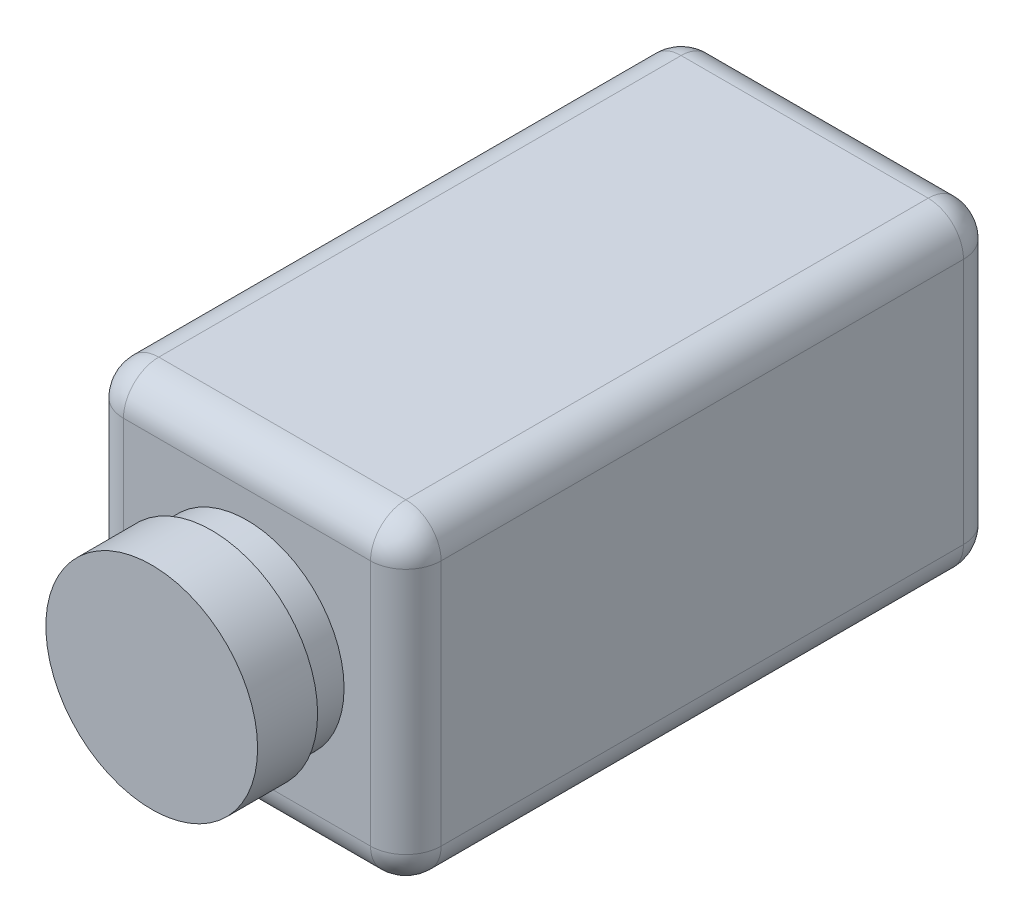
ISO-10303-21;
HEADER;
FILE_DESCRIPTION(('STEP AP214'),'2;1');
FILE_NAME('part.step','',(''),(''),'','','');
FILE_SCHEMA(('AUTOMOTIVE_DESIGN { 1 0 10303 214 1 1 1 1 }'));
ENDSEC;
DATA;
#1=APPLICATION_CONTEXT('core data for automotive mechanical design processes');
#2=APPLICATION_PROTOCOL_DEFINITION('international standard','automotive_design',2000,#1);
#3=PRODUCT_CONTEXT('',#1,'mechanical');
#4=PRODUCT('Part','Part','',(#3));
#5=PRODUCT_RELATED_PRODUCT_CATEGORY('part','',(#4));
#6=PRODUCT_DEFINITION_FORMATION('','',#4);
#7=PRODUCT_DEFINITION_CONTEXT('part definition',#1,'design');
#8=PRODUCT_DEFINITION('design','',#6,#7);
#9=PRODUCT_DEFINITION_SHAPE('','',#8);
#10=(LENGTH_UNIT() NAMED_UNIT(*) SI_UNIT(.MILLI.,.METRE.));
#11=(NAMED_UNIT(*) PLANE_ANGLE_UNIT() SI_UNIT($,.RADIAN.));
#12=(NAMED_UNIT(*) SI_UNIT($,.STERADIAN.) SOLID_ANGLE_UNIT());
#13=UNCERTAINTY_MEASURE_WITH_UNIT(LENGTH_MEASURE(1.E-05),#10,'distance_accuracy_value','');
#14=(GEOMETRIC_REPRESENTATION_CONTEXT(3) GLOBAL_UNCERTAINTY_ASSIGNED_CONTEXT((#13)) GLOBAL_UNIT_ASSIGNED_CONTEXT((#10,
#11,#12)) REPRESENTATION_CONTEXT('',''));
#15=CARTESIAN_POINT('',(0.,0.,0.));
#16=DIRECTION('',(0.,0.,1.));
#17=DIRECTION('',(1.,0.,0.));
#18=AXIS2_PLACEMENT_3D('',#15,#16,#17);
#19=CARTESIAN_POINT('',(0.,0.,168.));
#20=DIRECTION('',(1.,0.,0.));
#21=DIRECTION('',(0.,1.,0.));
#22=AXIS2_PLACEMENT_3D('',#19,#20,#21);
#23=PLANE('',#22);
#24=DIRECTION('',(0.,0.,-1.));
#25=VECTOR('',#24,1.);
#26=CARTESIAN_POINT('',(0.,-80.,168.));
#27=LINE('',#26,#25);
#28=CARTESIAN_POINT('',(0.,-80.,10.));
#29=VERTEX_POINT('',#28);
#30=CARTESIAN_POINT('',(0.,-80.,158.));
#31=VERTEX_POINT('',#30);
#32=EDGE_CURVE('E180',#29,#31,#27,.F.);
#33=ORIENTED_EDGE('',*,*,#32,.T.);
#34=DIRECTION('',(0.,-1.,0.));
#35=VECTOR('',#34,1.);
#36=CARTESIAN_POINT('',(0.,0.,158.));
#37=LINE('',#36,#35);
#38=CARTESIAN_POINT('',(0.,-10.,158.));
#39=VERTEX_POINT('',#38);
#40=EDGE_CURVE('E182',#31,#39,#37,.F.);
#41=ORIENTED_EDGE('',*,*,#40,.T.);
#42=DIRECTION('',(0.,0.,-1.));
#43=VECTOR('',#42,1.);
#44=CARTESIAN_POINT('',(0.,-10.,168.));
#45=LINE('',#44,#43);
#46=CARTESIAN_POINT('',(0.,-10.,10.));
#47=VERTEX_POINT('',#46);
#48=EDGE_CURVE('E176',#39,#47,#45,.T.);
#49=ORIENTED_EDGE('',*,*,#48,.T.);
#50=DIRECTION('',(0.,-1.,0.));
#51=VECTOR('',#50,1.);
#52=CARTESIAN_POINT('',(0.,0.,10.));
#53=LINE('',#52,#51);
#54=EDGE_CURVE('E178',#47,#29,#53,.T.);
#55=ORIENTED_EDGE('',*,*,#54,.T.);
#56=EDGE_LOOP('',(#33,#41,#49,#55));
#57=FACE_BOUND('',#56,.T.);
#58=ADVANCED_FACE('F32',(#57),#23,.F.);
#59=CARTESIAN_POINT('',(0.,-90.,168.));
#60=DIRECTION('',(0.,1.,0.));
#61=DIRECTION('',(0.,0.,1.));
#62=AXIS2_PLACEMENT_3D('',#59,#60,#61);
#63=PLANE('',#62);
#64=DIRECTION('',(1.,0.,0.));
#65=VECTOR('',#64,1.);
#66=CARTESIAN_POINT('',(0.,-90.,158.));
#67=LINE('',#66,#65);
#68=CARTESIAN_POINT('',(80.,-90.,158.));
#69=VERTEX_POINT('',#68);
#70=CARTESIAN_POINT('',(10.,-90.,158.));
#71=VERTEX_POINT('',#70);
#72=EDGE_CURVE('E128',#69,#71,#67,.F.);
#73=ORIENTED_EDGE('',*,*,#72,.T.);
#74=DIRECTION('',(0.,0.,-1.));
#75=VECTOR('',#74,1.);
#76=CARTESIAN_POINT('',(10.,-90.,168.));
#77=LINE('',#76,#75);
#78=CARTESIAN_POINT('',(10.,-90.,10.));
#79=VERTEX_POINT('',#78);
#80=EDGE_CURVE('E165',#71,#79,#77,.T.);
#81=ORIENTED_EDGE('',*,*,#80,.T.);
#82=DIRECTION('',(1.,0.,0.));
#83=VECTOR('',#82,1.);
#84=CARTESIAN_POINT('',(0.,-90.,10.));
#85=LINE('',#84,#83);
#86=CARTESIAN_POINT('',(80.,-90.,10.));
#87=VERTEX_POINT('',#86);
#88=EDGE_CURVE('E158',#79,#87,#85,.T.);
#89=ORIENTED_EDGE('',*,*,#88,.T.);
#90=DIRECTION('',(0.,0.,-1.));
#91=VECTOR('',#90,1.);
#92=CARTESIAN_POINT('',(80.,-90.,168.));
#93=LINE('',#92,#91);
#94=EDGE_CURVE('E156',#87,#69,#93,.F.);
#95=ORIENTED_EDGE('',*,*,#94,.T.);
#96=EDGE_LOOP('',(#73,#81,#89,#95));
#97=FACE_BOUND('',#96,.T.);
#98=ADVANCED_FACE('F326',(#97),#63,.F.);
#99=CARTESIAN_POINT('',(90.,0.,168.));
#100=DIRECTION('',(-1.,0.,0.));
#101=DIRECTION('',(0.,-1.,0.));
#102=AXIS2_PLACEMENT_3D('',#99,#100,#101);
#103=PLANE('',#102);
#104=DIRECTION('',(0.,1.,0.));
#105=VECTOR('',#104,1.);
#106=CARTESIAN_POINT('',(90.,-90.,158.));
#107=LINE('',#106,#105);
#108=CARTESIAN_POINT('',(90.,-10.,158.));
#109=VERTEX_POINT('',#108);
#110=CARTESIAN_POINT('',(90.,-80.,158.));
#111=VERTEX_POINT('',#110);
#112=EDGE_CURVE('E41',#109,#111,#107,.F.);
#113=ORIENTED_EDGE('',*,*,#112,.T.);
#114=DIRECTION('',(0.,0.,-1.));
#115=VECTOR('',#114,1.);
#116=CARTESIAN_POINT('',(90.,-80.,168.));
#117=LINE('',#116,#115);
#118=CARTESIAN_POINT('',(90.,-80.,10.));
#119=VERTEX_POINT('',#118);
#120=EDGE_CURVE('E11',#111,#119,#117,.T.);
#121=ORIENTED_EDGE('',*,*,#120,.T.);
#122=DIRECTION('',(0.,1.,0.));
#123=VECTOR('',#122,1.);
#124=CARTESIAN_POINT('',(90.,0.,10.));
#125=LINE('',#124,#123);
#126=CARTESIAN_POINT('',(90.,-10.,10.));
#127=VERTEX_POINT('',#126);
#128=EDGE_CURVE('E194',#119,#127,#125,.T.);
#129=ORIENTED_EDGE('',*,*,#128,.T.);
#130=DIRECTION('',(0.,0.,-1.));
#131=VECTOR('',#130,1.);
#132=CARTESIAN_POINT('',(90.,-10.,168.));
#133=LINE('',#132,#131);
#134=EDGE_CURVE('E52',#127,#109,#133,.F.);
#135=ORIENTED_EDGE('',*,*,#134,.T.);
#136=EDGE_LOOP('',(#113,#121,#129,#135));
#137=FACE_BOUND('',#136,.T.);
#138=ADVANCED_FACE('F331',(#137),#103,.F.);
#139=CARTESIAN_POINT('',(0.,0.,168.));
#140=DIRECTION('',(0.,-1.,0.));
#141=DIRECTION('',(0.,0.,-1.));
#142=AXIS2_PLACEMENT_3D('',#139,#140,#141);
#143=PLANE('',#142);
#144=DIRECTION('',(0.,0.,-1.));
#145=VECTOR('',#144,1.);
#146=CARTESIAN_POINT('',(10.,0.,168.));
#147=LINE('',#146,#145);
#148=CARTESIAN_POINT('',(10.,0.,10.));
#149=VERTEX_POINT('',#148);
#150=CARTESIAN_POINT('',(10.,0.,158.));
#151=VERTEX_POINT('',#150);
#152=EDGE_CURVE('E189',#149,#151,#147,.F.);
#153=ORIENTED_EDGE('',*,*,#152,.T.);
#154=DIRECTION('',(-1.,0.,0.));
#155=VECTOR('',#154,1.);
#156=CARTESIAN_POINT('',(90.,0.,158.));
#157=LINE('',#156,#155);
#158=CARTESIAN_POINT('',(80.,0.,158.));
#159=VERTEX_POINT('',#158);
#160=EDGE_CURVE('E191',#151,#159,#157,.F.);
#161=ORIENTED_EDGE('',*,*,#160,.T.);
#162=DIRECTION('',(0.,0.,-1.));
#163=VECTOR('',#162,1.);
#164=CARTESIAN_POINT('',(80.,0.,168.));
#165=LINE('',#164,#163);
#166=CARTESIAN_POINT('',(80.,0.,10.));
#167=VERTEX_POINT('',#166);
#168=EDGE_CURVE('E185',#159,#167,#165,.T.);
#169=ORIENTED_EDGE('',*,*,#168,.T.);
#170=DIRECTION('',(-1.,0.,0.));
#171=VECTOR('',#170,1.);
#172=CARTESIAN_POINT('',(0.,0.,10.));
#173=LINE('',#172,#171);
#174=EDGE_CURVE('E187',#167,#149,#173,.T.);
#175=ORIENTED_EDGE('',*,*,#174,.T.);
#176=EDGE_LOOP('',(#153,#161,#169,#175));
#177=FACE_BOUND('',#176,.T.);
#178=ADVANCED_FACE('F277',(#177),#143,.F.);
#179=CARTESIAN_POINT('',(0.,0.,168.));
#180=DIRECTION('',(0.,0.,1.));
#181=DIRECTION('',(1.,0.,0.));
#182=AXIS2_PLACEMENT_3D('',#179,#180,#181);
#183=PLANE('',#182);
#184=CARTESIAN_POINT('',(45.,-45.,168.));
#185=DIRECTION('',(0.,0.,1.));
#186=DIRECTION('',(1.,0.,0.));
#187=AXIS2_PLACEMENT_3D('',#184,#185,#186);
#188=CIRCLE('',#187,27.5);
#189=CARTESIAN_POINT('',(72.5,-45.,168.));
#190=VERTEX_POINT('',#189);
#191=EDGE_CURVE('E388',#190,#190,#188,.T.);
#192=ORIENTED_EDGE('',*,*,#191,.F.);
#193=EDGE_LOOP('',(#192));
#194=FACE_BOUND('',#193,.T.);
#195=DIRECTION('',(0.,-1.,0.));
#196=VECTOR('',#195,1.);
#197=CARTESIAN_POINT('',(10.,-90.,168.));
#198=LINE('',#197,#196);
#199=CARTESIAN_POINT('',(10.,-10.,168.));
#200=VERTEX_POINT('',#199);
#201=CARTESIAN_POINT('',(10.,-80.,168.));
#202=VERTEX_POINT('',#201);
#203=EDGE_CURVE('E154',#200,#202,#198,.T.);
#204=ORIENTED_EDGE('',*,*,#203,.T.);
#205=DIRECTION('',(1.,0.,0.));
#206=VECTOR('',#205,1.);
#207=CARTESIAN_POINT('',(90.,-80.,168.));
#208=LINE('',#207,#206);
#209=CARTESIAN_POINT('',(80.,-80.,168.));
#210=VERTEX_POINT('',#209);
#211=EDGE_CURVE('E126',#202,#210,#208,.T.);
#212=ORIENTED_EDGE('',*,*,#211,.T.);
#213=DIRECTION('',(0.,1.,0.));
#214=VECTOR('',#213,1.);
#215=CARTESIAN_POINT('',(80.,0.,168.));
#216=LINE('',#215,#214);
#217=CARTESIAN_POINT('',(80.,-10.,168.));
#218=VERTEX_POINT('',#217);
#219=EDGE_CURVE('E144',#210,#218,#216,.T.);
#220=ORIENTED_EDGE('',*,*,#219,.T.);
#221=DIRECTION('',(-1.,0.,0.));
#222=VECTOR('',#221,1.);
#223=CARTESIAN_POINT('',(0.,-10.,168.));
#224=LINE('',#223,#222);
#225=EDGE_CURVE('E150',#218,#200,#224,.T.);
#226=ORIENTED_EDGE('',*,*,#225,.T.);
#227=EDGE_LOOP('',(#204,#212,#220,#226));
#228=FACE_BOUND('',#227,.T.);
#229=ADVANCED_FACE('F152',(#194,#228),#183,.T.);
#230=CARTESIAN_POINT('',(0.,0.,0.));
#231=DIRECTION('',(0.,0.,1.));
#232=DIRECTION('',(1.,0.,0.));
#233=AXIS2_PLACEMENT_3D('',#230,#231,#232);
#234=PLANE('',#233);
#235=DIRECTION('',(0.,1.,0.));
#236=VECTOR('',#235,1.);
#237=CARTESIAN_POINT('',(80.,0.,0.));
#238=LINE('',#237,#236);
#239=CARTESIAN_POINT('',(80.,-10.,0.));
#240=VERTEX_POINT('',#239);
#241=CARTESIAN_POINT('',(80.,-80.,0.));
#242=VERTEX_POINT('',#241);
#243=EDGE_CURVE('E167',#240,#242,#238,.F.);
#244=ORIENTED_EDGE('',*,*,#243,.T.);
#245=DIRECTION('',(1.,0.,0.));
#246=VECTOR('',#245,1.);
#247=CARTESIAN_POINT('',(0.,-80.,0.));
#248=LINE('',#247,#246);
#249=CARTESIAN_POINT('',(10.,-80.,0.));
#250=VERTEX_POINT('',#249);
#251=EDGE_CURVE('E173',#242,#250,#248,.F.);
#252=ORIENTED_EDGE('',*,*,#251,.T.);
#253=DIRECTION('',(0.,-1.,0.));
#254=VECTOR('',#253,1.);
#255=CARTESIAN_POINT('',(10.,0.,0.));
#256=LINE('',#255,#254);
#257=CARTESIAN_POINT('',(10.,-10.,0.));
#258=VERTEX_POINT('',#257);
#259=EDGE_CURVE('E171',#250,#258,#256,.F.);
#260=ORIENTED_EDGE('',*,*,#259,.T.);
#261=DIRECTION('',(-1.,0.,0.));
#262=VECTOR('',#261,1.);
#263=CARTESIAN_POINT('',(0.,-10.,0.));
#264=LINE('',#263,#262);
#265=EDGE_CURVE('E169',#258,#240,#264,.F.);
#266=ORIENTED_EDGE('',*,*,#265,.T.);
#267=EDGE_LOOP('',(#244,#252,#260,#266));
#268=FACE_BOUND('',#267,.T.);
#269=ADVANCED_FACE('F295',(#268),#234,.F.);
#270=CARTESIAN_POINT('',(0.,-10.,10.));
#271=DIRECTION('',(-1.,0.,0.));
#272=DIRECTION('',(0.,0.,1.));
#273=AXIS2_PLACEMENT_3D('',#270,#271,#272);
#274=CYLINDRICAL_SURFACE('',#273,10.);
#275=CARTESIAN_POINT('',(10.,-10.,10.));
#276=DIRECTION('',(-1.,0.,0.));
#277=DIRECTION('',(0.,0.,1.));
#278=AXIS2_PLACEMENT_3D('',#275,#276,#277);
#279=CIRCLE('',#278,10.);
#280=EDGE_CURVE('E36',#149,#258,#279,.T.);
#281=ORIENTED_EDGE('',*,*,#280,.F.);
#282=ORIENTED_EDGE('',*,*,#174,.F.);
#283=CARTESIAN_POINT('',(80.,-10.,10.));
#284=DIRECTION('',(1.,0.,0.));
#285=DIRECTION('',(0.,0.,-1.));
#286=AXIS2_PLACEMENT_3D('',#283,#284,#285);
#287=CIRCLE('',#286,10.);
#288=EDGE_CURVE('E246',#240,#167,#287,.T.);
#289=ORIENTED_EDGE('',*,*,#288,.F.);
#290=ORIENTED_EDGE('',*,*,#265,.F.);
#291=EDGE_LOOP('',(#281,#282,#289,#290));
#292=FACE_BOUND('',#291,.T.);
#293=ADVANCED_FACE('F34',(#292),#274,.T.);
#294=CARTESIAN_POINT('',(10.,-10.,10.));
#295=DIRECTION('',(0.,0.,1.));
#296=DIRECTION('',(1.,0.,0.));
#297=AXIS2_PLACEMENT_3D('',#294,#295,#296);
#298=SPHERICAL_SURFACE('',#297,10.);
#299=CARTESIAN_POINT('',(10.,-10.,10.));
#300=DIRECTION('',(0.,0.,-1.));
#301=DIRECTION('',(-1.,0.,0.));
#302=AXIS2_PLACEMENT_3D('',#299,#300,#301);
#303=CIRCLE('',#302,10.);
#304=EDGE_CURVE('E241',#149,#47,#303,.F.);
#305=ORIENTED_EDGE('',*,*,#304,.F.);
#306=ORIENTED_EDGE('',*,*,#280,.T.);
#307=CARTESIAN_POINT('',(10.,-10.,10.));
#308=DIRECTION('',(0.,1.,0.));
#309=DIRECTION('',(-1.,0.,0.));
#310=AXIS2_PLACEMENT_3D('',#307,#308,#309);
#311=CIRCLE('',#310,10.);
#312=EDGE_CURVE('E244',#47,#258,#311,.F.);
#313=ORIENTED_EDGE('',*,*,#312,.F.);
#314=EDGE_LOOP('',(#305,#306,#313));
#315=FACE_BOUND('',#314,.T.);
#316=ADVANCED_FACE('F257',(#315),#298,.T.);
#317=CARTESIAN_POINT('',(80.,-10.,10.));
#318=DIRECTION('',(0.,0.,1.));
#319=DIRECTION('',(1.,0.,0.));
#320=AXIS2_PLACEMENT_3D('',#317,#318,#319);
#321=SPHERICAL_SURFACE('',#320,10.);
#322=CARTESIAN_POINT('',(80.,-10.,10.));
#323=DIRECTION('',(0.,1.,0.));
#324=DIRECTION('',(-1.,0.,0.));
#325=AXIS2_PLACEMENT_3D('',#322,#323,#324);
#326=CIRCLE('',#325,10.);
#327=EDGE_CURVE('E235',#240,#127,#326,.F.);
#328=ORIENTED_EDGE('',*,*,#327,.F.);
#329=ORIENTED_EDGE('',*,*,#288,.T.);
#330=CARTESIAN_POINT('',(80.,-10.,10.));
#331=DIRECTION('',(0.,0.,-1.));
#332=DIRECTION('',(-1.,0.,0.));
#333=AXIS2_PLACEMENT_3D('',#330,#331,#332);
#334=CIRCLE('',#333,10.);
#335=EDGE_CURVE('E238',#127,#167,#334,.F.);
#336=ORIENTED_EDGE('',*,*,#335,.F.);
#337=EDGE_LOOP('',(#328,#329,#336));
#338=FACE_BOUND('',#337,.T.);
#339=ADVANCED_FACE('F288',(#338),#321,.T.);
#340=CARTESIAN_POINT('',(10.,0.,10.));
#341=DIRECTION('',(0.,-1.,0.));
#342=DIRECTION('',(1.,0.,0.));
#343=AXIS2_PLACEMENT_3D('',#340,#341,#342);
#344=CYLINDRICAL_SURFACE('',#343,10.);
#345=ORIENTED_EDGE('',*,*,#312,.T.);
#346=ORIENTED_EDGE('',*,*,#259,.F.);
#347=CARTESIAN_POINT('',(10.,-80.,10.));
#348=DIRECTION('',(0.,-1.,0.));
#349=DIRECTION('',(0.,0.,-1.));
#350=AXIS2_PLACEMENT_3D('',#347,#348,#349);
#351=CIRCLE('',#350,10.);
#352=EDGE_CURVE('E230',#29,#250,#351,.T.);
#353=ORIENTED_EDGE('',*,*,#352,.F.);
#354=ORIENTED_EDGE('',*,*,#54,.F.);
#355=EDGE_LOOP('',(#345,#346,#353,#354));
#356=FACE_BOUND('',#355,.T.);
#357=ADVANCED_FACE('F265',(#356),#344,.T.);
#358=CARTESIAN_POINT('',(10.,-10.,168.));
#359=DIRECTION('',(0.,0.,-1.));
#360=DIRECTION('',(-1.,0.,0.));
#361=AXIS2_PLACEMENT_3D('',#358,#359,#360);
#362=CYLINDRICAL_SURFACE('',#361,10.);
#363=ORIENTED_EDGE('',*,*,#304,.T.);
#364=ORIENTED_EDGE('',*,*,#48,.F.);
#365=CARTESIAN_POINT('',(10.,-10.,158.));
#366=DIRECTION('',(0.,0.,1.));
#367=DIRECTION('',(1.,0.,0.));
#368=AXIS2_PLACEMENT_3D('',#365,#366,#367);
#369=CIRCLE('',#368,10.);
#370=EDGE_CURVE('E227',#151,#39,#369,.T.);
#371=ORIENTED_EDGE('',*,*,#370,.F.);
#372=ORIENTED_EDGE('',*,*,#152,.F.);
#373=EDGE_LOOP('',(#363,#364,#371,#372));
#374=FACE_BOUND('',#373,.T.);
#375=ADVANCED_FACE('F274',(#374),#362,.T.);
#376=CARTESIAN_POINT('',(0.,-10.,158.));
#377=DIRECTION('',(1.,0.,0.));
#378=DIRECTION('',(0.,0.,-1.));
#379=AXIS2_PLACEMENT_3D('',#376,#377,#378);
#380=CYLINDRICAL_SURFACE('',#379,10.);
#381=CARTESIAN_POINT('',(80.,-10.,158.));
#382=DIRECTION('',(1.,0.,0.));
#383=DIRECTION('',(0.,0.,-1.));
#384=AXIS2_PLACEMENT_3D('',#381,#382,#383);
#385=CIRCLE('',#384,10.);
#386=EDGE_CURVE('E221',#159,#218,#385,.T.);
#387=ORIENTED_EDGE('',*,*,#386,.F.);
#388=ORIENTED_EDGE('',*,*,#160,.F.);
#389=CARTESIAN_POINT('',(10.,-10.,158.));
#390=DIRECTION('',(-1.,0.,0.));
#391=DIRECTION('',(0.,-1.,0.));
#392=AXIS2_PLACEMENT_3D('',#389,#390,#391);
#393=CIRCLE('',#392,10.);
#394=EDGE_CURVE('E224',#200,#151,#393,.T.);
#395=ORIENTED_EDGE('',*,*,#394,.F.);
#396=ORIENTED_EDGE('',*,*,#225,.F.);
#397=EDGE_LOOP('',(#387,#388,#395,#396));
#398=FACE_BOUND('',#397,.T.);
#399=ADVANCED_FACE('F281',(#398),#380,.T.);
#400=CARTESIAN_POINT('',(80.,-10.,168.));
#401=DIRECTION('',(0.,0.,-1.));
#402=DIRECTION('',(-1.,0.,0.));
#403=AXIS2_PLACEMENT_3D('',#400,#401,#402);
#404=CYLINDRICAL_SURFACE('',#403,10.);
#405=ORIENTED_EDGE('',*,*,#335,.T.);
#406=ORIENTED_EDGE('',*,*,#168,.F.);
#407=CARTESIAN_POINT('',(80.,-10.,158.));
#408=DIRECTION('',(0.,0.,1.));
#409=DIRECTION('',(1.,0.,0.));
#410=AXIS2_PLACEMENT_3D('',#407,#408,#409);
#411=CIRCLE('',#410,10.);
#412=EDGE_CURVE('E219',#109,#159,#411,.T.);
#413=ORIENTED_EDGE('',*,*,#412,.F.);
#414=ORIENTED_EDGE('',*,*,#134,.F.);
#415=EDGE_LOOP('',(#405,#406,#413,#414));
#416=FACE_BOUND('',#415,.T.);
#417=ADVANCED_FACE('F286',(#416),#404,.T.);
#418=CARTESIAN_POINT('',(80.,0.,10.));
#419=DIRECTION('',(0.,1.,0.));
#420=DIRECTION('',(-1.,0.,0.));
#421=AXIS2_PLACEMENT_3D('',#418,#419,#420);
#422=CYLINDRICAL_SURFACE('',#421,10.);
#423=ORIENTED_EDGE('',*,*,#327,.T.);
#424=ORIENTED_EDGE('',*,*,#128,.F.);
#425=CARTESIAN_POINT('',(80.,-80.,10.));
#426=DIRECTION('',(0.,-1.,0.));
#427=DIRECTION('',(0.,0.,-1.));
#428=AXIS2_PLACEMENT_3D('',#425,#426,#427);
#429=CIRCLE('',#428,10.);
#430=EDGE_CURVE('E216',#242,#119,#429,.T.);
#431=ORIENTED_EDGE('',*,*,#430,.F.);
#432=ORIENTED_EDGE('',*,*,#243,.F.);
#433=EDGE_LOOP('',(#423,#424,#431,#432));
#434=FACE_BOUND('',#433,.T.);
#435=ADVANCED_FACE('F292',(#434),#422,.T.);
#436=CARTESIAN_POINT('',(0.,-80.,10.));
#437=DIRECTION('',(1.,0.,0.));
#438=DIRECTION('',(0.,0.,-1.));
#439=AXIS2_PLACEMENT_3D('',#436,#437,#438);
#440=CYLINDRICAL_SURFACE('',#439,10.);
#441=CARTESIAN_POINT('',(10.,-80.,10.));
#442=DIRECTION('',(-1.,0.,0.));
#443=DIRECTION('',(0.,0.,1.));
#444=AXIS2_PLACEMENT_3D('',#441,#442,#443);
#445=CIRCLE('',#444,10.);
#446=EDGE_CURVE('E232',#250,#79,#445,.T.);
#447=ORIENTED_EDGE('',*,*,#446,.F.);
#448=ORIENTED_EDGE('',*,*,#251,.F.);
#449=CARTESIAN_POINT('',(80.,-80.,10.));
#450=DIRECTION('',(1.,0.,0.));
#451=DIRECTION('',(0.,0.,-1.));
#452=AXIS2_PLACEMENT_3D('',#449,#450,#451);
#453=CIRCLE('',#452,10.);
#454=EDGE_CURVE('E213',#87,#242,#453,.T.);
#455=ORIENTED_EDGE('',*,*,#454,.F.);
#456=ORIENTED_EDGE('',*,*,#88,.F.);
#457=EDGE_LOOP('',(#447,#448,#455,#456));
#458=FACE_BOUND('',#457,.T.);
#459=ADVANCED_FACE('F299',(#458),#440,.T.);
#460=CARTESIAN_POINT('',(10.,-80.,10.));
#461=DIRECTION('',(0.,0.,1.));
#462=DIRECTION('',(1.,0.,0.));
#463=AXIS2_PLACEMENT_3D('',#460,#461,#462);
#464=SPHERICAL_SURFACE('',#463,10.);
#465=ORIENTED_EDGE('',*,*,#352,.T.);
#466=ORIENTED_EDGE('',*,*,#446,.T.);
#467=CARTESIAN_POINT('',(10.,-80.,10.));
#468=DIRECTION('',(0.,0.,-1.));
#469=DIRECTION('',(-1.,0.,0.));
#470=AXIS2_PLACEMENT_3D('',#467,#468,#469);
#471=CIRCLE('',#470,10.);
#472=EDGE_CURVE('E210',#29,#79,#471,.F.);
#473=ORIENTED_EDGE('',*,*,#472,.F.);
#474=EDGE_LOOP('',(#465,#466,#473));
#475=FACE_BOUND('',#474,.T.);
#476=ADVANCED_FACE('F303',(#475),#464,.T.);
#477=CARTESIAN_POINT('',(10.,-10.,158.));
#478=DIRECTION('',(0.,0.,1.));
#479=DIRECTION('',(1.,0.,0.));
#480=AXIS2_PLACEMENT_3D('',#477,#478,#479);
#481=SPHERICAL_SURFACE('',#480,10.);
#482=ORIENTED_EDGE('',*,*,#394,.T.);
#483=ORIENTED_EDGE('',*,*,#370,.T.);
#484=CARTESIAN_POINT('',(10.,-10.,158.));
#485=DIRECTION('',(0.,1.,0.));
#486=DIRECTION('',(-1.,0.,0.));
#487=AXIS2_PLACEMENT_3D('',#484,#485,#486);
#488=CIRCLE('',#487,10.);
#489=EDGE_CURVE('E208',#200,#39,#488,.F.);
#490=ORIENTED_EDGE('',*,*,#489,.F.);
#491=EDGE_LOOP('',(#482,#483,#490));
#492=FACE_BOUND('',#491,.T.);
#493=ADVANCED_FACE('F314',(#492),#481,.T.);
#494=CARTESIAN_POINT('',(80.,-10.,158.));
#495=DIRECTION('',(0.,0.,1.));
#496=DIRECTION('',(1.,0.,0.));
#497=AXIS2_PLACEMENT_3D('',#494,#495,#496);
#498=SPHERICAL_SURFACE('',#497,10.);
#499=ORIENTED_EDGE('',*,*,#412,.T.);
#500=ORIENTED_EDGE('',*,*,#386,.T.);
#501=CARTESIAN_POINT('',(80.,-10.,158.));
#502=DIRECTION('',(0.,1.,0.));
#503=DIRECTION('',(-1.,0.,0.));
#504=AXIS2_PLACEMENT_3D('',#501,#502,#503);
#505=CIRCLE('',#504,10.);
#506=EDGE_CURVE('E147',#109,#218,#505,.F.);
#507=ORIENTED_EDGE('',*,*,#506,.F.);
#508=EDGE_LOOP('',(#499,#500,#507));
#509=FACE_BOUND('',#508,.T.);
#510=ADVANCED_FACE('F316',(#509),#498,.T.);
#511=CARTESIAN_POINT('',(80.,-80.,10.));
#512=DIRECTION('',(0.,0.,1.));
#513=DIRECTION('',(1.,0.,0.));
#514=AXIS2_PLACEMENT_3D('',#511,#512,#513);
#515=SPHERICAL_SURFACE('',#514,10.);
#516=ORIENTED_EDGE('',*,*,#454,.T.);
#517=ORIENTED_EDGE('',*,*,#430,.T.);
#518=CARTESIAN_POINT('',(80.,-80.,10.));
#519=DIRECTION('',(0.,0.,-1.));
#520=DIRECTION('',(-1.,0.,0.));
#521=AXIS2_PLACEMENT_3D('',#518,#519,#520);
#522=CIRCLE('',#521,10.);
#523=EDGE_CURVE('E205',#87,#119,#522,.F.);
#524=ORIENTED_EDGE('',*,*,#523,.F.);
#525=EDGE_LOOP('',(#516,#517,#524));
#526=FACE_BOUND('',#525,.T.);
#527=ADVANCED_FACE('F322',(#526),#515,.T.);
#528=CARTESIAN_POINT('',(10.,-80.,168.));
#529=DIRECTION('',(0.,0.,-1.));
#530=DIRECTION('',(-1.,0.,0.));
#531=AXIS2_PLACEMENT_3D('',#528,#529,#530);
#532=CYLINDRICAL_SURFACE('',#531,10.);
#533=ORIENTED_EDGE('',*,*,#472,.T.);
#534=ORIENTED_EDGE('',*,*,#80,.F.);
#535=CARTESIAN_POINT('',(10.,-80.,158.));
#536=DIRECTION('',(0.,0.,1.));
#537=DIRECTION('',(1.,0.,0.));
#538=AXIS2_PLACEMENT_3D('',#535,#536,#537);
#539=CIRCLE('',#538,10.);
#540=EDGE_CURVE('E202',#31,#71,#539,.T.);
#541=ORIENTED_EDGE('',*,*,#540,.F.);
#542=ORIENTED_EDGE('',*,*,#32,.F.);
#543=EDGE_LOOP('',(#533,#534,#541,#542));
#544=FACE_BOUND('',#543,.T.);
#545=ADVANCED_FACE('F306',(#544),#532,.T.);
#546=CARTESIAN_POINT('',(10.,0.,158.));
#547=DIRECTION('',(0.,1.,0.));
#548=DIRECTION('',(-1.,0.,0.));
#549=AXIS2_PLACEMENT_3D('',#546,#547,#548);
#550=CYLINDRICAL_SURFACE('',#549,10.);
#551=ORIENTED_EDGE('',*,*,#489,.T.);
#552=ORIENTED_EDGE('',*,*,#40,.F.);
#553=CARTESIAN_POINT('',(10.,-80.,158.));
#554=DIRECTION('',(0.,-1.,0.));
#555=DIRECTION('',(0.,0.,-1.));
#556=AXIS2_PLACEMENT_3D('',#553,#554,#555);
#557=CIRCLE('',#556,10.);
#558=EDGE_CURVE('E141',#202,#31,#557,.T.);
#559=ORIENTED_EDGE('',*,*,#558,.F.);
#560=ORIENTED_EDGE('',*,*,#203,.F.);
#561=EDGE_LOOP('',(#551,#552,#559,#560));
#562=FACE_BOUND('',#561,.T.);
#563=ADVANCED_FACE('F312',(#562),#550,.T.);
#564=CARTESIAN_POINT('',(80.,0.,158.));
#565=DIRECTION('',(0.,-1.,0.));
#566=DIRECTION('',(1.,0.,0.));
#567=AXIS2_PLACEMENT_3D('',#564,#565,#566);
#568=CYLINDRICAL_SURFACE('',#567,10.);
#569=ORIENTED_EDGE('',*,*,#506,.T.);
#570=ORIENTED_EDGE('',*,*,#219,.F.);
#571=CARTESIAN_POINT('',(80.,-80.,158.));
#572=DIRECTION('',(0.,-1.,0.));
#573=DIRECTION('',(0.,0.,-1.));
#574=AXIS2_PLACEMENT_3D('',#571,#572,#573);
#575=CIRCLE('',#574,10.);
#576=EDGE_CURVE('E135',#111,#210,#575,.T.);
#577=ORIENTED_EDGE('',*,*,#576,.F.);
#578=ORIENTED_EDGE('',*,*,#112,.F.);
#579=EDGE_LOOP('',(#569,#570,#577,#578));
#580=FACE_BOUND('',#579,.T.);
#581=ADVANCED_FACE('F145',(#580),#568,.T.);
#582=CARTESIAN_POINT('',(80.,-80.,168.));
#583=DIRECTION('',(0.,0.,-1.));
#584=DIRECTION('',(-1.,0.,0.));
#585=AXIS2_PLACEMENT_3D('',#582,#583,#584);
#586=CYLINDRICAL_SURFACE('',#585,10.);
#587=ORIENTED_EDGE('',*,*,#523,.T.);
#588=ORIENTED_EDGE('',*,*,#120,.F.);
#589=CARTESIAN_POINT('',(80.,-80.,158.));
#590=DIRECTION('',(0.,0.,1.));
#591=DIRECTION('',(1.,0.,0.));
#592=AXIS2_PLACEMENT_3D('',#589,#590,#591);
#593=CIRCLE('',#592,10.);
#594=EDGE_CURVE('E139',#69,#111,#593,.T.);
#595=ORIENTED_EDGE('',*,*,#594,.F.);
#596=ORIENTED_EDGE('',*,*,#94,.F.);
#597=EDGE_LOOP('',(#587,#588,#595,#596));
#598=FACE_BOUND('',#597,.T.);
#599=ADVANCED_FACE('F343',(#598),#586,.T.);
#600=CARTESIAN_POINT('',(10.,-80.,158.));
#601=DIRECTION('',(0.,0.,1.));
#602=DIRECTION('',(1.,0.,0.));
#603=AXIS2_PLACEMENT_3D('',#600,#601,#602);
#604=SPHERICAL_SURFACE('',#603,10.);
#605=ORIENTED_EDGE('',*,*,#558,.T.);
#606=ORIENTED_EDGE('',*,*,#540,.T.);
#607=CARTESIAN_POINT('',(10.,-80.,158.));
#608=DIRECTION('',(-1.,0.,0.));
#609=DIRECTION('',(0.,0.,1.));
#610=AXIS2_PLACEMENT_3D('',#607,#608,#609);
#611=CIRCLE('',#610,10.);
#612=EDGE_CURVE('E131',#202,#71,#611,.F.);
#613=ORIENTED_EDGE('',*,*,#612,.F.);
#614=EDGE_LOOP('',(#605,#606,#613));
#615=FACE_BOUND('',#614,.T.);
#616=ADVANCED_FACE('F310',(#615),#604,.T.);
#617=CARTESIAN_POINT('',(80.,-80.,158.));
#618=DIRECTION('',(0.,0.,1.));
#619=DIRECTION('',(1.,0.,0.));
#620=AXIS2_PLACEMENT_3D('',#617,#618,#619);
#621=SPHERICAL_SURFACE('',#620,10.);
#622=ORIENTED_EDGE('',*,*,#594,.T.);
#623=ORIENTED_EDGE('',*,*,#576,.T.);
#624=CARTESIAN_POINT('',(80.,-80.,158.));
#625=DIRECTION('',(1.,0.,0.));
#626=DIRECTION('',(0.,0.,-1.));
#627=AXIS2_PLACEMENT_3D('',#624,#625,#626);
#628=CIRCLE('',#627,10.);
#629=EDGE_CURVE('E122',#69,#210,#628,.F.);
#630=ORIENTED_EDGE('',*,*,#629,.F.);
#631=EDGE_LOOP('',(#622,#623,#630));
#632=FACE_BOUND('',#631,.T.);
#633=ADVANCED_FACE('F137',(#632),#621,.T.);
#634=CARTESIAN_POINT('',(0.,-80.,158.));
#635=DIRECTION('',(-1.,0.,0.));
#636=DIRECTION('',(0.,0.,1.));
#637=AXIS2_PLACEMENT_3D('',#634,#635,#636);
#638=CYLINDRICAL_SURFACE('',#637,10.);
#639=ORIENTED_EDGE('',*,*,#612,.T.);
#640=ORIENTED_EDGE('',*,*,#72,.F.);
#641=ORIENTED_EDGE('',*,*,#629,.T.);
#642=ORIENTED_EDGE('',*,*,#211,.F.);
#643=EDGE_LOOP('',(#639,#640,#641,#642));
#644=FACE_BOUND('',#643,.T.);
#645=ADVANCED_FACE('F124',(#644),#638,.T.);
#646=CARTESIAN_POINT('',(45.,-45.,178.));
#647=DIRECTION('',(0.,0.,-1.));
#648=DIRECTION('',(-1.,0.,0.));
#649=AXIS2_PLACEMENT_3D('',#646,#647,#648);
#650=CYLINDRICAL_SURFACE('',#649,27.5);
#651=CARTESIAN_POINT('',(45.,-45.,178.));
#652=DIRECTION('',(0.,0.,1.));
#653=DIRECTION('',(1.,0.,0.));
#654=AXIS2_PLACEMENT_3D('',#651,#652,#653);
#655=CIRCLE('',#654,27.5);
#656=CARTESIAN_POINT('',(72.5,-45.,178.));
#657=VERTEX_POINT('',#656);
#658=EDGE_CURVE('E132',#657,#657,#655,.T.);
#659=ORIENTED_EDGE('',*,*,#658,.F.);
#660=EDGE_LOOP('',(#659));
#661=FACE_BOUND('',#660,.T.);
#662=ORIENTED_EDGE('',*,*,#191,.T.);
#663=EDGE_LOOP('',(#662));
#664=FACE_BOUND('',#663,.T.);
#665=ADVANCED_FACE('F338',(#661,#664),#650,.T.);
#666=CARTESIAN_POINT('',(45.,-45.,195.));
#667=DIRECTION('',(0.,0.,-1.));
#668=DIRECTION('',(-1.,0.,0.));
#669=AXIS2_PLACEMENT_3D('',#666,#667,#668);
#670=CYLINDRICAL_SURFACE('',#669,30.);
#671=CARTESIAN_POINT('',(45.,-45.,195.));
#672=DIRECTION('',(0.,0.,1.));
#673=DIRECTION('',(1.,0.,0.));
#674=AXIS2_PLACEMENT_3D('',#671,#672,#673);
#675=CIRCLE('',#674,30.);
#676=CARTESIAN_POINT('',(75.,-45.,195.));
#677=VERTEX_POINT('',#676);
#678=EDGE_CURVE('E387',#677,#677,#675,.T.);
#679=ORIENTED_EDGE('',*,*,#678,.F.);
#680=EDGE_LOOP('',(#679));
#681=FACE_BOUND('',#680,.T.);
#682=CARTESIAN_POINT('',(45.,-45.,178.));
#683=DIRECTION('',(0.,0.,1.));
#684=DIRECTION('',(1.,0.,0.));
#685=AXIS2_PLACEMENT_3D('',#682,#683,#684);
#686=CIRCLE('',#685,30.);
#687=CARTESIAN_POINT('',(75.,-45.,178.));
#688=VERTEX_POINT('',#687);
#689=EDGE_CURVE('E389',#688,#688,#686,.T.);
#690=ORIENTED_EDGE('',*,*,#689,.T.);
#691=EDGE_LOOP('',(#690));
#692=FACE_BOUND('',#691,.T.);
#693=ADVANCED_FACE('F371',(#681,#692),#670,.T.);
#694=CARTESIAN_POINT('',(45.,-45.,195.));
#695=DIRECTION('',(0.,0.,1.));
#696=DIRECTION('',(1.,0.,0.));
#697=AXIS2_PLACEMENT_3D('',#694,#695,#696);
#698=PLANE('',#697);
#699=ORIENTED_EDGE('',*,*,#678,.T.);
#700=EDGE_LOOP('',(#699));
#701=FACE_BOUND('',#700,.T.);
#702=ADVANCED_FACE('F375',(#701),#698,.T.);
#703=CARTESIAN_POINT('',(45.,-45.,178.));
#704=DIRECTION('',(0.,0.,1.));
#705=DIRECTION('',(1.,0.,0.));
#706=AXIS2_PLACEMENT_3D('',#703,#704,#705);
#707=PLANE('',#706);
#708=ORIENTED_EDGE('',*,*,#658,.T.);
#709=EDGE_LOOP('',(#708));
#710=FACE_BOUND('',#709,.T.);
#711=ORIENTED_EDGE('',*,*,#689,.F.);
#712=EDGE_LOOP('',(#711));
#713=FACE_BOUND('',#712,.T.);
#714=ADVANCED_FACE('F377',(#710,#713),#707,.F.);
#715=CLOSED_SHELL('',(#58,#98,#138,#178,#229,#269,#293,#316,#339,#357,#375,#399,#417,#435,#459,
#476,#493,#510,#527,#545,#563,#581,#599,#616,#633,#645,#665,#693,#702,#714));
#716=MANIFOLD_SOLID_BREP('B2',#715);
#717=ADVANCED_BREP_SHAPE_REPRESENTATION('',(#18,#716),#14);
#718=SHAPE_DEFINITION_REPRESENTATION(#9,#717);
ENDSEC;
END-ISO-10303-21;
